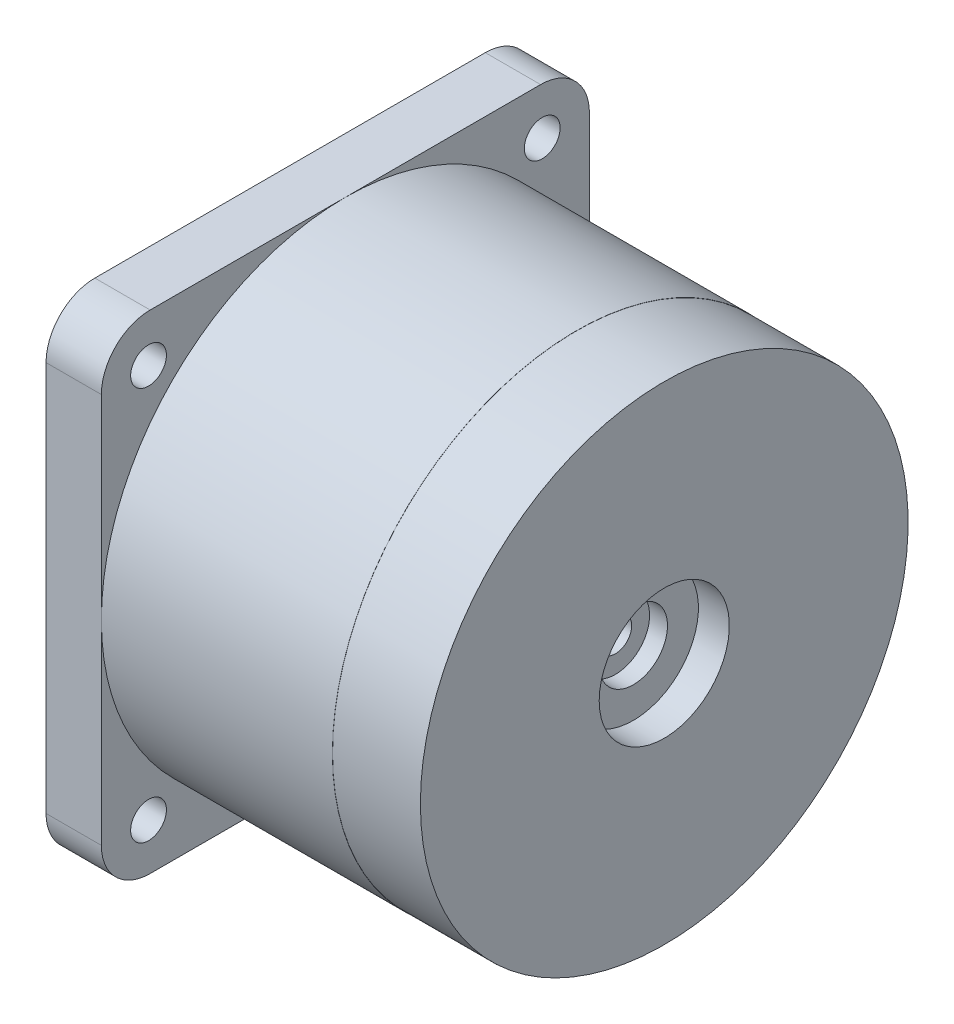
ISO-10303-21;
HEADER;
FILE_DESCRIPTION(('STEP AP214'),'2;1');
FILE_NAME('part.step','',(''),(''),'','','');
FILE_SCHEMA(('AUTOMOTIVE_DESIGN { 1 0 10303 214 1 1 1 1 }'));
ENDSEC;
DATA;
#1=APPLICATION_CONTEXT('core data for automotive mechanical design processes');
#2=APPLICATION_PROTOCOL_DEFINITION('international standard','automotive_design',2000,#1);
#3=PRODUCT_CONTEXT('',#1,'mechanical');
#4=PRODUCT('Part','Part','',(#3));
#5=PRODUCT_RELATED_PRODUCT_CATEGORY('part','',(#4));
#6=PRODUCT_DEFINITION_FORMATION('','',#4);
#7=PRODUCT_DEFINITION_CONTEXT('part definition',#1,'design');
#8=PRODUCT_DEFINITION('design','',#6,#7);
#9=PRODUCT_DEFINITION_SHAPE('','',#8);
#10=(LENGTH_UNIT() NAMED_UNIT(*) SI_UNIT(.MILLI.,.METRE.));
#11=(NAMED_UNIT(*) PLANE_ANGLE_UNIT() SI_UNIT($,.RADIAN.));
#12=(NAMED_UNIT(*) SI_UNIT($,.STERADIAN.) SOLID_ANGLE_UNIT());
#13=UNCERTAINTY_MEASURE_WITH_UNIT(LENGTH_MEASURE(1.E-05),#10,'distance_accuracy_value','');
#14=(GEOMETRIC_REPRESENTATION_CONTEXT(3) GLOBAL_UNCERTAINTY_ASSIGNED_CONTEXT((#13)) GLOBAL_UNIT_ASSIGNED_CONTEXT((#10,
#11,#12)) REPRESENTATION_CONTEXT('',''));
#15=CARTESIAN_POINT('',(0.,0.,0.));
#16=DIRECTION('',(0.,0.,1.));
#17=DIRECTION('',(1.,0.,0.));
#18=AXIS2_PLACEMENT_3D('',#15,#16,#17);
#19=CARTESIAN_POINT('',(0.,0.,0.));
#20=DIRECTION('',(-1.,0.,0.));
#21=DIRECTION('',(0.,0.,1.));
#22=AXIS2_PLACEMENT_3D('',#19,#20,#21);
#23=PLANE('',#22);
#24=CARTESIAN_POINT('',(0.,0.,0.));
#25=DIRECTION('',(-1.,0.,0.));
#26=DIRECTION('',(0.,0.,1.));
#27=AXIS2_PLACEMENT_3D('',#24,#25,#26);
#28=CIRCLE('',#27,14.99);
#29=CARTESIAN_POINT('',(0.,0.,14.99));
#30=VERTEX_POINT('',#29);
#31=EDGE_CURVE('E169',#30,#30,#28,.T.);
#32=ORIENTED_EDGE('',*,*,#31,.F.);
#33=EDGE_LOOP('',(#32));
#34=FACE_BOUND('',#33,.T.);
#35=CARTESIAN_POINT('',(0.,0.,0.));
#36=DIRECTION('',(-1.,0.,0.));
#37=DIRECTION('',(0.,0.,1.));
#38=AXIS2_PLACEMENT_3D('',#35,#36,#37);
#39=CIRCLE('',#38,4.);
#40=CARTESIAN_POINT('',(0.,0.,4.));
#41=VERTEX_POINT('',#40);
#42=EDGE_CURVE('E261',#41,#41,#39,.T.);
#43=ORIENTED_EDGE('',*,*,#42,.T.);
#44=EDGE_LOOP('',(#43));
#45=FACE_BOUND('',#44,.T.);
#46=ADVANCED_FACE('F32',(#34,#45),#23,.F.);
#47=CARTESIAN_POINT('',(-21.4,0.,0.));
#48=DIRECTION('',(-1.,0.,0.));
#49=DIRECTION('',(0.,0.,1.));
#50=AXIS2_PLACEMENT_3D('',#47,#48,#49);
#51=PLANE('',#50);
#52=CARTESIAN_POINT('',(-21.4,0.,0.));
#53=DIRECTION('',(-1.,0.,0.));
#54=DIRECTION('',(0.,0.,1.));
#55=AXIS2_PLACEMENT_3D('',#52,#53,#54);
#56=CIRCLE('',#55,13.5);
#57=CARTESIAN_POINT('',(-21.4,0.,13.5));
#58=VERTEX_POINT('',#57);
#59=EDGE_CURVE('E249',#58,#58,#56,.T.);
#60=ORIENTED_EDGE('',*,*,#59,.T.);
#61=EDGE_LOOP('',(#60));
#62=FACE_BOUND('',#61,.T.);
#63=CARTESIAN_POINT('',(-21.4,-4.9,0.));
#64=DIRECTION('',(-1.,0.,0.));
#65=DIRECTION('',(0.,0.,1.));
#66=AXIS2_PLACEMENT_3D('',#63,#64,#65);
#67=CIRCLE('',#66,5.);
#68=CARTESIAN_POINT('',(-21.4,-4.9,5.));
#69=VERTEX_POINT('',#68);
#70=EDGE_CURVE('E258',#69,#69,#67,.T.);
#71=ORIENTED_EDGE('',*,*,#70,.F.);
#72=EDGE_LOOP('',(#71));
#73=FACE_BOUND('',#72,.T.);
#74=ADVANCED_FACE('F292',(#62,#73),#51,.T.);
#75=CARTESIAN_POINT('',(0.,0.,0.));
#76=DIRECTION('',(-1.,0.,0.));
#77=DIRECTION('',(0.,0.,1.));
#78=AXIS2_PLACEMENT_3D('',#75,#76,#77);
#79=CYLINDRICAL_SURFACE('',#78,14.99);
#80=CARTESIAN_POINT('',(-5.4,0.,0.));
#81=DIRECTION('',(-1.,0.,0.));
#82=DIRECTION('',(0.,0.,1.));
#83=AXIS2_PLACEMENT_3D('',#80,#81,#82);
#84=CIRCLE('',#83,14.99);
#85=CARTESIAN_POINT('',(-5.4,0.,14.99));
#86=VERTEX_POINT('',#85);
#87=EDGE_CURVE('E166',#86,#86,#84,.T.);
#88=ORIENTED_EDGE('',*,*,#87,.F.);
#89=EDGE_LOOP('',(#88));
#90=FACE_BOUND('',#89,.T.);
#91=ORIENTED_EDGE('',*,*,#31,.T.);
#92=EDGE_LOOP('',(#91));
#93=FACE_BOUND('',#92,.T.);
#94=ADVANCED_FACE('F297',(#90,#93),#79,.T.);
#95=CARTESIAN_POINT('',(-5.4,14.99,0.));
#96=DIRECTION('',(-1.,0.,0.));
#97=DIRECTION('',(0.,0.,1.));
#98=AXIS2_PLACEMENT_3D('',#95,#96,#97);
#99=PLANE('',#98);
#100=CARTESIAN_POINT('',(-5.4,0.,0.));
#101=DIRECTION('',(-1.,0.,0.));
#102=DIRECTION('',(0.,0.,1.));
#103=AXIS2_PLACEMENT_3D('',#100,#101,#102);
#104=CIRCLE('',#103,15.);
#105=CARTESIAN_POINT('',(-5.4,0.,15.));
#106=VERTEX_POINT('',#105);
#107=EDGE_CURVE('E137',#106,#106,#104,.T.);
#108=ORIENTED_EDGE('',*,*,#107,.F.);
#109=EDGE_LOOP('',(#108));
#110=FACE_BOUND('',#109,.T.);
#111=ORIENTED_EDGE('',*,*,#87,.T.);
#112=EDGE_LOOP('',(#111));
#113=FACE_BOUND('',#112,.T.);
#114=ADVANCED_FACE('F373',(#110,#113),#99,.F.);
#115=CARTESIAN_POINT('',(0.,0.,0.));
#116=DIRECTION('',(-1.,0.,0.));
#117=DIRECTION('',(0.,0.,1.));
#118=AXIS2_PLACEMENT_3D('',#115,#116,#117);
#119=CYLINDRICAL_SURFACE('',#118,15.);
#120=CARTESIAN_POINT('',(-19.6,0.,0.));
#121=DIRECTION('',(-1.,0.,0.));
#122=DIRECTION('',(0.,0.,1.));
#123=AXIS2_PLACEMENT_3D('',#120,#121,#122);
#124=CIRCLE('',#123,15.);
#125=CARTESIAN_POINT('',(-19.6,0.,15.));
#126=VERTEX_POINT('',#125);
#127=CARTESIAN_POINT('',(-19.6,15.,0.));
#128=VERTEX_POINT('',#127);
#129=EDGE_CURVE('E126',#126,#128,#124,.T.);
#130=ORIENTED_EDGE('',*,*,#129,.F.);
#131=CARTESIAN_POINT('',(-19.6,-15.,0.));
#132=VERTEX_POINT('',#131);
#133=EDGE_CURVE('E130',#132,#126,#124,.T.);
#134=ORIENTED_EDGE('',*,*,#133,.F.);
#135=CARTESIAN_POINT('',(-19.6,0.,-15.));
#136=VERTEX_POINT('',#135);
#137=EDGE_CURVE('E143',#136,#132,#124,.T.);
#138=ORIENTED_EDGE('',*,*,#137,.F.);
#139=EDGE_CURVE('E133',#128,#136,#124,.T.);
#140=ORIENTED_EDGE('',*,*,#139,.F.);
#141=EDGE_LOOP('',(#130,#134,#138,#140));
#142=FACE_BOUND('',#141,.T.);
#143=ORIENTED_EDGE('',*,*,#107,.T.);
#144=EDGE_LOOP('',(#143));
#145=FACE_BOUND('',#144,.T.);
#146=ADVANCED_FACE('F127',(#142,#145),#119,.T.);
#147=CARTESIAN_POINT('',(-19.6,-15.,-15.));
#148=DIRECTION('',(-1.,0.,0.));
#149=DIRECTION('',(0.,0.,1.));
#150=AXIS2_PLACEMENT_3D('',#147,#148,#149);
#151=PLANE('',#150);
#152=CARTESIAN_POINT('',(-19.6,12.1,12.1));
#153=DIRECTION('',(-1.,0.,0.));
#154=DIRECTION('',(0.,0.,1.));
#155=AXIS2_PLACEMENT_3D('',#152,#153,#154);
#156=CIRCLE('',#155,1.1);
#157=CARTESIAN_POINT('',(-19.6,12.1,13.2));
#158=VERTEX_POINT('',#157);
#159=EDGE_CURVE('E234',#158,#158,#156,.T.);
#160=ORIENTED_EDGE('',*,*,#159,.T.);
#161=EDGE_LOOP('',(#160));
#162=FACE_BOUND('',#161,.T.);
#163=DIRECTION('',(0.,0.,-1.));
#164=VECTOR('',#163,1.);
#165=CARTESIAN_POINT('',(-19.6,15.,-15.));
#166=LINE('',#165,#164);
#167=CARTESIAN_POINT('',(-19.6,15.,12.));
#168=VERTEX_POINT('',#167);
#169=EDGE_CURVE('E151',#168,#128,#166,.T.);
#170=ORIENTED_EDGE('',*,*,#169,.F.);
#171=CARTESIAN_POINT('',(-19.6,12.,12.));
#172=DIRECTION('',(-1.,0.,0.));
#173=DIRECTION('',(0.,0.,1.));
#174=AXIS2_PLACEMENT_3D('',#171,#172,#173);
#175=CIRCLE('',#174,3.);
#176=CARTESIAN_POINT('',(-19.6,12.,15.));
#177=VERTEX_POINT('',#176);
#178=EDGE_CURVE('E146',#168,#177,#175,.F.);
#179=ORIENTED_EDGE('',*,*,#178,.T.);
#180=DIRECTION('',(0.,1.,0.));
#181=VECTOR('',#180,1.);
#182=CARTESIAN_POINT('',(-19.6,15.,15.));
#183=LINE('',#182,#181);
#184=EDGE_CURVE('E113',#126,#177,#183,.T.);
#185=ORIENTED_EDGE('',*,*,#184,.F.);
#186=ORIENTED_EDGE('',*,*,#129,.T.);
#187=EDGE_LOOP('',(#170,#179,#185,#186));
#188=FACE_BOUND('',#187,.T.);
#189=ADVANCED_FACE('F145',(#162,#188),#151,.F.);
#190=CARTESIAN_POINT('',(-19.6,12.1,-12.1));
#191=DIRECTION('',(-1.,0.,0.));
#192=DIRECTION('',(0.,0.,1.));
#193=AXIS2_PLACEMENT_3D('',#190,#191,#192);
#194=CIRCLE('',#193,1.1);
#195=CARTESIAN_POINT('',(-19.6,12.1,-11.));
#196=VERTEX_POINT('',#195);
#197=EDGE_CURVE('E228',#196,#196,#194,.T.);
#198=ORIENTED_EDGE('',*,*,#197,.T.);
#199=EDGE_LOOP('',(#198));
#200=FACE_BOUND('',#199,.T.);
#201=DIRECTION('',(0.,-1.,0.));
#202=VECTOR('',#201,1.);
#203=CARTESIAN_POINT('',(-19.6,15.,-15.));
#204=LINE('',#203,#202);
#205=CARTESIAN_POINT('',(-19.6,12.,-15.));
#206=VERTEX_POINT('',#205);
#207=EDGE_CURVE('E218',#206,#136,#204,.T.);
#208=ORIENTED_EDGE('',*,*,#207,.F.);
#209=CARTESIAN_POINT('',(-19.6,12.,-12.));
#210=DIRECTION('',(-1.,0.,0.));
#211=DIRECTION('',(0.,0.,1.));
#212=AXIS2_PLACEMENT_3D('',#209,#210,#211);
#213=CIRCLE('',#212,3.);
#214=CARTESIAN_POINT('',(-19.6,15.,-12.));
#215=VERTEX_POINT('',#214);
#216=EDGE_CURVE('E11',#206,#215,#213,.F.);
#217=ORIENTED_EDGE('',*,*,#216,.T.);
#218=EDGE_CURVE('E120',#128,#215,#166,.T.);
#219=ORIENTED_EDGE('',*,*,#218,.F.);
#220=ORIENTED_EDGE('',*,*,#139,.T.);
#221=EDGE_LOOP('',(#208,#217,#219,#220));
#222=FACE_BOUND('',#221,.T.);
#223=ADVANCED_FACE('F217',(#200,#222),#151,.F.);
#224=CARTESIAN_POINT('',(-19.6,-12.1,-12.1));
#225=DIRECTION('',(-1.,0.,0.));
#226=DIRECTION('',(0.,0.,1.));
#227=AXIS2_PLACEMENT_3D('',#224,#225,#226);
#228=CIRCLE('',#227,1.1);
#229=CARTESIAN_POINT('',(-19.6,-12.1,-11.));
#230=VERTEX_POINT('',#229);
#231=EDGE_CURVE('E240',#230,#230,#228,.T.);
#232=ORIENTED_EDGE('',*,*,#231,.T.);
#233=EDGE_LOOP('',(#232));
#234=FACE_BOUND('',#233,.T.);
#235=DIRECTION('',(0.,0.,1.));
#236=VECTOR('',#235,1.);
#237=CARTESIAN_POINT('',(-19.6,-15.,-15.));
#238=LINE('',#237,#236);
#239=CARTESIAN_POINT('',(-19.6,-15.,-12.));
#240=VERTEX_POINT('',#239);
#241=EDGE_CURVE('E147',#240,#132,#238,.T.);
#242=ORIENTED_EDGE('',*,*,#241,.F.);
#243=CARTESIAN_POINT('',(-19.6,-12.,-12.));
#244=DIRECTION('',(-1.,0.,0.));
#245=DIRECTION('',(0.,0.,1.));
#246=AXIS2_PLACEMENT_3D('',#243,#244,#245);
#247=CIRCLE('',#246,3.);
#248=CARTESIAN_POINT('',(-19.6,-12.,-15.));
#249=VERTEX_POINT('',#248);
#250=EDGE_CURVE('E52',#240,#249,#247,.F.);
#251=ORIENTED_EDGE('',*,*,#250,.T.);
#252=EDGE_CURVE('E202',#136,#249,#204,.T.);
#253=ORIENTED_EDGE('',*,*,#252,.F.);
#254=ORIENTED_EDGE('',*,*,#137,.T.);
#255=EDGE_LOOP('',(#242,#251,#253,#254));
#256=FACE_BOUND('',#255,.T.);
#257=ADVANCED_FACE('F214',(#234,#256),#151,.F.);
#258=CARTESIAN_POINT('',(-19.6,-12.1,12.1));
#259=DIRECTION('',(-1.,0.,0.));
#260=DIRECTION('',(0.,0.,1.));
#261=AXIS2_PLACEMENT_3D('',#258,#259,#260);
#262=CIRCLE('',#261,1.1);
#263=CARTESIAN_POINT('',(-19.6,-12.1,13.2));
#264=VERTEX_POINT('',#263);
#265=EDGE_CURVE('E246',#264,#264,#262,.T.);
#266=ORIENTED_EDGE('',*,*,#265,.T.);
#267=EDGE_LOOP('',(#266));
#268=FACE_BOUND('',#267,.T.);
#269=CARTESIAN_POINT('',(-19.6,-12.,15.));
#270=VERTEX_POINT('',#269);
#271=EDGE_CURVE('E109',#270,#126,#183,.T.);
#272=ORIENTED_EDGE('',*,*,#271,.F.);
#273=CARTESIAN_POINT('',(-19.6,-12.,12.));
#274=DIRECTION('',(-1.,0.,0.));
#275=DIRECTION('',(0.,0.,1.));
#276=AXIS2_PLACEMENT_3D('',#273,#274,#275);
#277=CIRCLE('',#276,3.);
#278=CARTESIAN_POINT('',(-19.6,-15.,12.));
#279=VERTEX_POINT('',#278);
#280=EDGE_CURVE('E189',#270,#279,#277,.F.);
#281=ORIENTED_EDGE('',*,*,#280,.T.);
#282=EDGE_CURVE('E142',#132,#279,#238,.T.);
#283=ORIENTED_EDGE('',*,*,#282,.F.);
#284=ORIENTED_EDGE('',*,*,#133,.T.);
#285=EDGE_LOOP('',(#272,#281,#283,#284));
#286=FACE_BOUND('',#285,.T.);
#287=ADVANCED_FACE('F140',(#268,#286),#151,.F.);
#288=CARTESIAN_POINT('',(-23.,-15.,-15.));
#289=DIRECTION('',(-1.,0.,0.));
#290=DIRECTION('',(0.,0.,1.));
#291=AXIS2_PLACEMENT_3D('',#288,#289,#290);
#292=PLANE('',#291);
#293=CARTESIAN_POINT('',(-23.,0.,0.));
#294=DIRECTION('',(-1.,0.,0.));
#295=DIRECTION('',(0.,0.,1.));
#296=AXIS2_PLACEMENT_3D('',#293,#294,#295);
#297=CIRCLE('',#296,13.5);
#298=CARTESIAN_POINT('',(-23.,0.,13.5));
#299=VERTEX_POINT('',#298);
#300=EDGE_CURVE('E252',#299,#299,#297,.T.);
#301=ORIENTED_EDGE('',*,*,#300,.F.);
#302=EDGE_LOOP('',(#301));
#303=FACE_BOUND('',#302,.T.);
#304=CARTESIAN_POINT('',(-23.,-12.1,-12.1));
#305=DIRECTION('',(-1.,0.,0.));
#306=DIRECTION('',(0.,0.,1.));
#307=AXIS2_PLACEMENT_3D('',#304,#305,#306);
#308=CIRCLE('',#307,1.1);
#309=CARTESIAN_POINT('',(-23.,-12.1,-11.));
#310=VERTEX_POINT('',#309);
#311=EDGE_CURVE('E237',#310,#310,#308,.T.);
#312=ORIENTED_EDGE('',*,*,#311,.F.);
#313=EDGE_LOOP('',(#312));
#314=FACE_BOUND('',#313,.T.);
#315=CARTESIAN_POINT('',(-23.,12.1,-12.1));
#316=DIRECTION('',(-1.,0.,0.));
#317=DIRECTION('',(0.,0.,1.));
#318=AXIS2_PLACEMENT_3D('',#315,#316,#317);
#319=CIRCLE('',#318,1.1);
#320=CARTESIAN_POINT('',(-23.,12.1,-11.));
#321=VERTEX_POINT('',#320);
#322=EDGE_CURVE('E224',#321,#321,#319,.T.);
#323=ORIENTED_EDGE('',*,*,#322,.F.);
#324=EDGE_LOOP('',(#323));
#325=FACE_BOUND('',#324,.T.);
#326=DIRECTION('',(0.,1.,0.));
#327=VECTOR('',#326,1.);
#328=CARTESIAN_POINT('',(-23.,15.,15.));
#329=LINE('',#328,#327);
#330=CARTESIAN_POINT('',(-23.,-12.,15.));
#331=VERTEX_POINT('',#330);
#332=CARTESIAN_POINT('',(-23.,12.,15.));
#333=VERTEX_POINT('',#332);
#334=EDGE_CURVE('E159',#331,#333,#329,.T.);
#335=ORIENTED_EDGE('',*,*,#334,.T.);
#336=CARTESIAN_POINT('',(-23.,12.,12.));
#337=DIRECTION('',(-1.,0.,0.));
#338=DIRECTION('',(0.,0.,1.));
#339=AXIS2_PLACEMENT_3D('',#336,#337,#338);
#340=CIRCLE('',#339,3.);
#341=CARTESIAN_POINT('',(-23.,15.,12.));
#342=VERTEX_POINT('',#341);
#343=EDGE_CURVE('E187',#333,#342,#340,.T.);
#344=ORIENTED_EDGE('',*,*,#343,.T.);
#345=DIRECTION('',(0.,0.,-1.));
#346=VECTOR('',#345,1.);
#347=CARTESIAN_POINT('',(-23.,15.,-15.));
#348=LINE('',#347,#346);
#349=CARTESIAN_POINT('',(-23.,15.,-12.));
#350=VERTEX_POINT('',#349);
#351=EDGE_CURVE('E144',#342,#350,#348,.T.);
#352=ORIENTED_EDGE('',*,*,#351,.T.);
#353=CARTESIAN_POINT('',(-23.,12.,-12.));
#354=DIRECTION('',(-1.,0.,0.));
#355=DIRECTION('',(0.,0.,1.));
#356=AXIS2_PLACEMENT_3D('',#353,#354,#355);
#357=CIRCLE('',#356,3.);
#358=CARTESIAN_POINT('',(-23.,12.,-15.));
#359=VERTEX_POINT('',#358);
#360=EDGE_CURVE('E181',#350,#359,#357,.T.);
#361=ORIENTED_EDGE('',*,*,#360,.T.);
#362=DIRECTION('',(0.,-1.,0.));
#363=VECTOR('',#362,1.);
#364=CARTESIAN_POINT('',(-23.,15.,-15.));
#365=LINE('',#364,#363);
#366=CARTESIAN_POINT('',(-23.,-12.,-15.));
#367=VERTEX_POINT('',#366);
#368=EDGE_CURVE('E153',#359,#367,#365,.T.);
#369=ORIENTED_EDGE('',*,*,#368,.T.);
#370=CARTESIAN_POINT('',(-23.,-12.,-12.));
#371=DIRECTION('',(-1.,0.,0.));
#372=DIRECTION('',(0.,0.,1.));
#373=AXIS2_PLACEMENT_3D('',#370,#371,#372);
#374=CIRCLE('',#373,3.);
#375=CARTESIAN_POINT('',(-23.,-15.,-12.));
#376=VERTEX_POINT('',#375);
#377=EDGE_CURVE('E183',#367,#376,#374,.T.);
#378=ORIENTED_EDGE('',*,*,#377,.T.);
#379=DIRECTION('',(0.,0.,1.));
#380=VECTOR('',#379,1.);
#381=CARTESIAN_POINT('',(-23.,-15.,-15.));
#382=LINE('',#381,#380);
#383=CARTESIAN_POINT('',(-23.,-15.,12.));
#384=VERTEX_POINT('',#383);
#385=EDGE_CURVE('E156',#376,#384,#382,.T.);
#386=ORIENTED_EDGE('',*,*,#385,.T.);
#387=CARTESIAN_POINT('',(-23.,-12.,12.));
#388=DIRECTION('',(-1.,0.,0.));
#389=DIRECTION('',(0.,0.,1.));
#390=AXIS2_PLACEMENT_3D('',#387,#388,#389);
#391=CIRCLE('',#390,3.);
#392=EDGE_CURVE('E185',#384,#331,#391,.T.);
#393=ORIENTED_EDGE('',*,*,#392,.T.);
#394=EDGE_LOOP('',(#335,#344,#352,#361,#369,#378,#386,#393));
#395=FACE_BOUND('',#394,.T.);
#396=CARTESIAN_POINT('',(-23.,12.1,12.1));
#397=DIRECTION('',(-1.,0.,0.));
#398=DIRECTION('',(0.,0.,1.));
#399=AXIS2_PLACEMENT_3D('',#396,#397,#398);
#400=CIRCLE('',#399,1.1);
#401=CARTESIAN_POINT('',(-23.,12.1,13.2));
#402=VERTEX_POINT('',#401);
#403=EDGE_CURVE('E231',#402,#402,#400,.T.);
#404=ORIENTED_EDGE('',*,*,#403,.F.);
#405=EDGE_LOOP('',(#404));
#406=FACE_BOUND('',#405,.T.);
#407=CARTESIAN_POINT('',(-23.,-12.1,12.1));
#408=DIRECTION('',(-1.,0.,0.));
#409=DIRECTION('',(0.,0.,1.));
#410=AXIS2_PLACEMENT_3D('',#407,#408,#409);
#411=CIRCLE('',#410,1.1);
#412=CARTESIAN_POINT('',(-23.,-12.1,13.2));
#413=VERTEX_POINT('',#412);
#414=EDGE_CURVE('E243',#413,#413,#411,.T.);
#415=ORIENTED_EDGE('',*,*,#414,.F.);
#416=EDGE_LOOP('',(#415));
#417=FACE_BOUND('',#416,.T.);
#418=ADVANCED_FACE('F206',(#303,#314,#325,#395,#406,#417),#292,.T.);
#419=CARTESIAN_POINT('',(-23.,15.,-15.));
#420=DIRECTION('',(0.,0.,1.));
#421=DIRECTION('',(0.,-1.,0.));
#422=AXIS2_PLACEMENT_3D('',#419,#420,#421);
#423=PLANE('',#422);
#424=ORIENTED_EDGE('',*,*,#252,.T.);
#425=DIRECTION('',(1.,0.,0.));
#426=VECTOR('',#425,1.);
#427=CARTESIAN_POINT('',(-23.,-12.,-15.));
#428=LINE('',#427,#426);
#429=EDGE_CURVE('E39',#249,#367,#428,.F.);
#430=ORIENTED_EDGE('',*,*,#429,.T.);
#431=ORIENTED_EDGE('',*,*,#368,.F.);
#432=DIRECTION('',(1.,0.,0.));
#433=VECTOR('',#432,1.);
#434=CARTESIAN_POINT('',(-23.,12.,-15.));
#435=LINE('',#434,#433);
#436=EDGE_CURVE('E197',#359,#206,#435,.T.);
#437=ORIENTED_EDGE('',*,*,#436,.T.);
#438=ORIENTED_EDGE('',*,*,#207,.T.);
#439=EDGE_LOOP('',(#424,#430,#431,#437,#438));
#440=FACE_BOUND('',#439,.T.);
#441=ADVANCED_FACE('F201',(#440),#423,.F.);
#442=CARTESIAN_POINT('',(-23.,-15.,-15.));
#443=DIRECTION('',(0.,1.,0.));
#444=DIRECTION('',(0.,0.,1.));
#445=AXIS2_PLACEMENT_3D('',#442,#443,#444);
#446=PLANE('',#445);
#447=ORIENTED_EDGE('',*,*,#282,.T.);
#448=DIRECTION('',(1.,0.,0.));
#449=VECTOR('',#448,1.);
#450=CARTESIAN_POINT('',(-23.,-15.,12.));
#451=LINE('',#450,#449);
#452=EDGE_CURVE('E194',#279,#384,#451,.F.);
#453=ORIENTED_EDGE('',*,*,#452,.T.);
#454=ORIENTED_EDGE('',*,*,#385,.F.);
#455=DIRECTION('',(1.,0.,0.));
#456=VECTOR('',#455,1.);
#457=CARTESIAN_POINT('',(-23.,-15.,-12.));
#458=LINE('',#457,#456);
#459=EDGE_CURVE('E191',#376,#240,#458,.T.);
#460=ORIENTED_EDGE('',*,*,#459,.T.);
#461=ORIENTED_EDGE('',*,*,#241,.T.);
#462=EDGE_LOOP('',(#447,#453,#454,#460,#461));
#463=FACE_BOUND('',#462,.T.);
#464=ADVANCED_FACE('F213',(#463),#446,.F.);
#465=CARTESIAN_POINT('',(-23.,15.,15.));
#466=DIRECTION('',(0.,0.,-1.));
#467=DIRECTION('',(0.,1.,0.));
#468=AXIS2_PLACEMENT_3D('',#465,#466,#467);
#469=PLANE('',#468);
#470=ORIENTED_EDGE('',*,*,#184,.T.);
#471=DIRECTION('',(1.,0.,0.));
#472=VECTOR('',#471,1.);
#473=CARTESIAN_POINT('',(-23.,12.,15.));
#474=LINE('',#473,#472);
#475=EDGE_CURVE('E179',#177,#333,#474,.F.);
#476=ORIENTED_EDGE('',*,*,#475,.T.);
#477=ORIENTED_EDGE('',*,*,#334,.F.);
#478=DIRECTION('',(1.,0.,0.));
#479=VECTOR('',#478,1.);
#480=CARTESIAN_POINT('',(-23.,-12.,15.));
#481=LINE('',#480,#479);
#482=EDGE_CURVE('E117',#331,#270,#481,.T.);
#483=ORIENTED_EDGE('',*,*,#482,.T.);
#484=ORIENTED_EDGE('',*,*,#271,.T.);
#485=EDGE_LOOP('',(#470,#476,#477,#483,#484));
#486=FACE_BOUND('',#485,.T.);
#487=ADVANCED_FACE('F111',(#486),#469,.F.);
#488=CARTESIAN_POINT('',(-23.,15.,-15.));
#489=DIRECTION('',(0.,-1.,0.));
#490=DIRECTION('',(0.,0.,-1.));
#491=AXIS2_PLACEMENT_3D('',#488,#489,#490);
#492=PLANE('',#491);
#493=ORIENTED_EDGE('',*,*,#351,.F.);
#494=DIRECTION('',(1.,0.,0.));
#495=VECTOR('',#494,1.);
#496=CARTESIAN_POINT('',(-23.,15.,12.));
#497=LINE('',#496,#495);
#498=EDGE_CURVE('E174',#342,#168,#497,.T.);
#499=ORIENTED_EDGE('',*,*,#498,.T.);
#500=ORIENTED_EDGE('',*,*,#169,.T.);
#501=ORIENTED_EDGE('',*,*,#218,.T.);
#502=DIRECTION('',(1.,0.,0.));
#503=VECTOR('',#502,1.);
#504=CARTESIAN_POINT('',(-23.,15.,-12.));
#505=LINE('',#504,#503);
#506=EDGE_CURVE('E172',#215,#350,#505,.F.);
#507=ORIENTED_EDGE('',*,*,#506,.T.);
#508=EDGE_LOOP('',(#493,#499,#500,#501,#507));
#509=FACE_BOUND('',#508,.T.);
#510=ADVANCED_FACE('F222',(#509),#492,.F.);
#511=CARTESIAN_POINT('',(-23.,12.1,-12.1));
#512=DIRECTION('',(1.,0.,0.));
#513=DIRECTION('',(0.,0.,-1.));
#514=AXIS2_PLACEMENT_3D('',#511,#512,#513);
#515=CYLINDRICAL_SURFACE('',#514,1.1);
#516=ORIENTED_EDGE('',*,*,#322,.T.);
#517=EDGE_LOOP('',(#516));
#518=FACE_BOUND('',#517,.T.);
#519=ORIENTED_EDGE('',*,*,#197,.F.);
#520=EDGE_LOOP('',(#519));
#521=FACE_BOUND('',#520,.T.);
#522=ADVANCED_FACE('F352',(#518,#521),#515,.F.);
#523=CARTESIAN_POINT('',(-23.,12.1,12.1));
#524=DIRECTION('',(1.,0.,0.));
#525=DIRECTION('',(0.,0.,-1.));
#526=AXIS2_PLACEMENT_3D('',#523,#524,#525);
#527=CYLINDRICAL_SURFACE('',#526,1.1);
#528=ORIENTED_EDGE('',*,*,#403,.T.);
#529=EDGE_LOOP('',(#528));
#530=FACE_BOUND('',#529,.T.);
#531=ORIENTED_EDGE('',*,*,#159,.F.);
#532=EDGE_LOOP('',(#531));
#533=FACE_BOUND('',#532,.T.);
#534=ADVANCED_FACE('F348',(#530,#533),#527,.F.);
#535=CARTESIAN_POINT('',(-23.,-12.1,-12.1));
#536=DIRECTION('',(1.,0.,0.));
#537=DIRECTION('',(0.,0.,-1.));
#538=AXIS2_PLACEMENT_3D('',#535,#536,#537);
#539=CYLINDRICAL_SURFACE('',#538,1.1);
#540=ORIENTED_EDGE('',*,*,#311,.T.);
#541=EDGE_LOOP('',(#540));
#542=FACE_BOUND('',#541,.T.);
#543=ORIENTED_EDGE('',*,*,#231,.F.);
#544=EDGE_LOOP('',(#543));
#545=FACE_BOUND('',#544,.T.);
#546=ADVANCED_FACE('F344',(#542,#545),#539,.F.);
#547=CARTESIAN_POINT('',(-23.,-12.1,12.1));
#548=DIRECTION('',(1.,0.,0.));
#549=DIRECTION('',(0.,0.,-1.));
#550=AXIS2_PLACEMENT_3D('',#547,#548,#549);
#551=CYLINDRICAL_SURFACE('',#550,1.1);
#552=ORIENTED_EDGE('',*,*,#414,.T.);
#553=EDGE_LOOP('',(#552));
#554=FACE_BOUND('',#553,.T.);
#555=ORIENTED_EDGE('',*,*,#265,.F.);
#556=EDGE_LOOP('',(#555));
#557=FACE_BOUND('',#556,.T.);
#558=ADVANCED_FACE('F340',(#554,#557),#551,.F.);
#559=CARTESIAN_POINT('',(-21.4,0.,0.));
#560=DIRECTION('',(-1.,0.,0.));
#561=DIRECTION('',(0.,0.,1.));
#562=AXIS2_PLACEMENT_3D('',#559,#560,#561);
#563=CYLINDRICAL_SURFACE('',#562,13.5);
#564=ORIENTED_EDGE('',*,*,#59,.F.);
#565=EDGE_LOOP('',(#564));
#566=FACE_BOUND('',#565,.T.);
#567=ORIENTED_EDGE('',*,*,#300,.T.);
#568=EDGE_LOOP('',(#567));
#569=FACE_BOUND('',#568,.T.);
#570=ADVANCED_FACE('F335',(#566,#569),#563,.F.);
#571=CARTESIAN_POINT('',(-23.,12.,12.));
#572=DIRECTION('',(1.,0.,0.));
#573=DIRECTION('',(0.,0.,-1.));
#574=AXIS2_PLACEMENT_3D('',#571,#572,#573);
#575=CYLINDRICAL_SURFACE('',#574,3.);
#576=ORIENTED_EDGE('',*,*,#343,.F.);
#577=ORIENTED_EDGE('',*,*,#475,.F.);
#578=ORIENTED_EDGE('',*,*,#178,.F.);
#579=ORIENTED_EDGE('',*,*,#498,.F.);
#580=EDGE_LOOP('',(#576,#577,#578,#579));
#581=FACE_BOUND('',#580,.T.);
#582=ADVANCED_FACE('F332',(#581),#575,.T.);
#583=CARTESIAN_POINT('',(-23.,-12.,12.));
#584=DIRECTION('',(1.,0.,0.));
#585=DIRECTION('',(0.,0.,-1.));
#586=AXIS2_PLACEMENT_3D('',#583,#584,#585);
#587=CYLINDRICAL_SURFACE('',#586,3.);
#588=ORIENTED_EDGE('',*,*,#392,.F.);
#589=ORIENTED_EDGE('',*,*,#452,.F.);
#590=ORIENTED_EDGE('',*,*,#280,.F.);
#591=ORIENTED_EDGE('',*,*,#482,.F.);
#592=EDGE_LOOP('',(#588,#589,#590,#591));
#593=FACE_BOUND('',#592,.T.);
#594=ADVANCED_FACE('F329',(#593),#587,.T.);
#595=CARTESIAN_POINT('',(-23.,-12.,-12.));
#596=DIRECTION('',(1.,0.,0.));
#597=DIRECTION('',(0.,0.,-1.));
#598=AXIS2_PLACEMENT_3D('',#595,#596,#597);
#599=CYLINDRICAL_SURFACE('',#598,3.);
#600=ORIENTED_EDGE('',*,*,#377,.F.);
#601=ORIENTED_EDGE('',*,*,#429,.F.);
#602=ORIENTED_EDGE('',*,*,#250,.F.);
#603=ORIENTED_EDGE('',*,*,#459,.F.);
#604=EDGE_LOOP('',(#600,#601,#602,#603));
#605=FACE_BOUND('',#604,.T.);
#606=ADVANCED_FACE('F211',(#605),#599,.T.);
#607=CARTESIAN_POINT('',(-23.,12.,-12.));
#608=DIRECTION('',(1.,0.,0.));
#609=DIRECTION('',(0.,0.,-1.));
#610=AXIS2_PLACEMENT_3D('',#607,#608,#609);
#611=CYLINDRICAL_SURFACE('',#610,3.);
#612=ORIENTED_EDGE('',*,*,#360,.F.);
#613=ORIENTED_EDGE('',*,*,#506,.F.);
#614=ORIENTED_EDGE('',*,*,#216,.F.);
#615=ORIENTED_EDGE('',*,*,#436,.F.);
#616=EDGE_LOOP('',(#612,#613,#614,#615));
#617=FACE_BOUND('',#616,.T.);
#618=ADVANCED_FACE('F223',(#617),#611,.T.);
#619=CARTESIAN_POINT('',(-28.95,-4.9,0.));
#620=DIRECTION('',(1.,0.,0.));
#621=DIRECTION('',(0.,0.,-1.));
#622=AXIS2_PLACEMENT_3D('',#619,#620,#621);
#623=CYLINDRICAL_SURFACE('',#622,5.);
#624=CARTESIAN_POINT('',(-28.95,-4.9,0.));
#625=DIRECTION('',(-1.,0.,0.));
#626=DIRECTION('',(0.,0.,1.));
#627=AXIS2_PLACEMENT_3D('',#624,#625,#626);
#628=CIRCLE('',#627,5.);
#629=CARTESIAN_POINT('',(-28.95,-4.9,5.));
#630=VERTEX_POINT('',#629);
#631=EDGE_CURVE('E255',#630,#630,#628,.T.);
#632=ORIENTED_EDGE('',*,*,#631,.F.);
#633=EDGE_LOOP('',(#632));
#634=FACE_BOUND('',#633,.T.);
#635=ORIENTED_EDGE('',*,*,#70,.T.);
#636=EDGE_LOOP('',(#635));
#637=FACE_BOUND('',#636,.T.);
#638=ADVANCED_FACE('F317',(#634,#637),#623,.T.);
#639=CARTESIAN_POINT('',(-28.95,-4.9,0.));
#640=DIRECTION('',(-1.,0.,0.));
#641=DIRECTION('',(0.,0.,1.));
#642=AXIS2_PLACEMENT_3D('',#639,#640,#641);
#643=PLANE('',#642);
#644=ORIENTED_EDGE('',*,*,#631,.T.);
#645=EDGE_LOOP('',(#644));
#646=FACE_BOUND('',#645,.T.);
#647=ADVANCED_FACE('F307',(#646),#643,.T.);
#648=CARTESIAN_POINT('',(0.,0.,0.));
#649=DIRECTION('',(-1.,0.,0.));
#650=DIRECTION('',(0.,0.,1.));
#651=AXIS2_PLACEMENT_3D('',#648,#649,#650);
#652=CYLINDRICAL_SURFACE('',#651,4.);
#653=CARTESIAN_POINT('',(-1.9,0.,0.));
#654=DIRECTION('',(-1.,0.,0.));
#655=DIRECTION('',(0.,0.,1.));
#656=AXIS2_PLACEMENT_3D('',#653,#654,#655);
#657=CIRCLE('',#656,4.);
#658=CARTESIAN_POINT('',(-1.9,0.,4.));
#659=VERTEX_POINT('',#658);
#660=EDGE_CURVE('E264',#659,#659,#657,.T.);
#661=ORIENTED_EDGE('',*,*,#660,.T.);
#662=EDGE_LOOP('',(#661));
#663=FACE_BOUND('',#662,.T.);
#664=ORIENTED_EDGE('',*,*,#42,.F.);
#665=EDGE_LOOP('',(#664));
#666=FACE_BOUND('',#665,.T.);
#667=ADVANCED_FACE('F304',(#663,#666),#652,.F.);
#668=CARTESIAN_POINT('',(-1.9,4.,0.));
#669=DIRECTION('',(1.,0.,0.));
#670=DIRECTION('',(0.,0.,-1.));
#671=AXIS2_PLACEMENT_3D('',#668,#669,#670);
#672=PLANE('',#671);
#673=CARTESIAN_POINT('',(-1.9,0.,0.));
#674=DIRECTION('',(-1.,0.,0.));
#675=DIRECTION('',(0.,0.,1.));
#676=AXIS2_PLACEMENT_3D('',#673,#674,#675);
#677=CIRCLE('',#676,2.1);
#678=CARTESIAN_POINT('',(-1.9,0.,2.1));
#679=VERTEX_POINT('',#678);
#680=EDGE_CURVE('E267',#679,#679,#677,.T.);
#681=ORIENTED_EDGE('',*,*,#680,.T.);
#682=EDGE_LOOP('',(#681));
#683=FACE_BOUND('',#682,.T.);
#684=ORIENTED_EDGE('',*,*,#660,.F.);
#685=EDGE_LOOP('',(#684));
#686=FACE_BOUND('',#685,.T.);
#687=ADVANCED_FACE('F306',(#683,#686),#672,.T.);
#688=CARTESIAN_POINT('',(0.,0.,0.));
#689=DIRECTION('',(-1.,0.,0.));
#690=DIRECTION('',(0.,0.,1.));
#691=AXIS2_PLACEMENT_3D('',#688,#689,#690);
#692=CYLINDRICAL_SURFACE('',#691,2.1);
#693=CARTESIAN_POINT('',(-3.,0.,0.));
#694=DIRECTION('',(-1.,0.,0.));
#695=DIRECTION('',(0.,0.,1.));
#696=AXIS2_PLACEMENT_3D('',#693,#694,#695);
#697=CIRCLE('',#696,2.1);
#698=CARTESIAN_POINT('',(-3.,0.,2.1));
#699=VERTEX_POINT('',#698);
#700=EDGE_CURVE('E270',#699,#699,#697,.T.);
#701=ORIENTED_EDGE('',*,*,#700,.T.);
#702=EDGE_LOOP('',(#701));
#703=FACE_BOUND('',#702,.T.);
#704=ORIENTED_EDGE('',*,*,#680,.F.);
#705=EDGE_LOOP('',(#704));
#706=FACE_BOUND('',#705,.T.);
#707=ADVANCED_FACE('F314',(#703,#706),#692,.F.);
#708=CARTESIAN_POINT('',(-3.,2.1,0.));
#709=DIRECTION('',(1.,0.,0.));
#710=DIRECTION('',(0.,0.,-1.));
#711=AXIS2_PLACEMENT_3D('',#708,#709,#710);
#712=PLANE('',#711);
#713=CARTESIAN_POINT('',(-3.,0.,0.));
#714=DIRECTION('',(-1.,0.,0.));
#715=DIRECTION('',(0.,0.,1.));
#716=AXIS2_PLACEMENT_3D('',#713,#714,#715);
#717=CIRCLE('',#716,1.);
#718=CARTESIAN_POINT('',(-3.,0.,1.));
#719=VERTEX_POINT('',#718);
#720=EDGE_CURVE('E273',#719,#719,#717,.T.);
#721=ORIENTED_EDGE('',*,*,#720,.T.);
#722=EDGE_LOOP('',(#721));
#723=FACE_BOUND('',#722,.T.);
#724=ORIENTED_EDGE('',*,*,#700,.F.);
#725=EDGE_LOOP('',(#724));
#726=FACE_BOUND('',#725,.T.);
#727=ADVANCED_FACE('F289',(#723,#726),#712,.T.);
#728=CARTESIAN_POINT('',(0.,0.,0.));
#729=DIRECTION('',(-1.,0.,0.));
#730=DIRECTION('',(0.,0.,1.));
#731=AXIS2_PLACEMENT_3D('',#728,#729,#730);
#732=CYLINDRICAL_SURFACE('',#731,1.);
#733=CARTESIAN_POINT('',(-11.5,0.,0.));
#734=DIRECTION('',(-1.,0.,0.));
#735=DIRECTION('',(0.,0.,1.));
#736=AXIS2_PLACEMENT_3D('',#733,#734,#735);
#737=CIRCLE('',#736,0.999999999999999);
#738=CARTESIAN_POINT('',(-11.5,0.,0.999999999999999));
#739=VERTEX_POINT('',#738);
#740=EDGE_CURVE('E276',#739,#739,#737,.T.);
#741=ORIENTED_EDGE('',*,*,#740,.T.);
#742=EDGE_LOOP('',(#741));
#743=FACE_BOUND('',#742,.T.);
#744=ORIENTED_EDGE('',*,*,#720,.F.);
#745=EDGE_LOOP('',(#744));
#746=FACE_BOUND('',#745,.T.);
#747=ADVANCED_FACE('F280',(#743,#746),#732,.F.);
#748=CARTESIAN_POINT('',(-11.5,0.999999999999999,0.));
#749=DIRECTION('',(1.,0.,0.));
#750=DIRECTION('',(0.,0.,-1.));
#751=AXIS2_PLACEMENT_3D('',#748,#749,#750);
#752=PLANE('',#751);
#753=ORIENTED_EDGE('',*,*,#740,.F.);
#754=EDGE_LOOP('',(#753));
#755=FACE_BOUND('',#754,.T.);
#756=ADVANCED_FACE('F283',(#755),#752,.T.);
#757=CLOSED_SHELL('',(#46,#74,#94,#114,#146,#189,#223,#257,#287,#418,#441,#464,#487,#510,#522,
#534,#546,#558,#570,#582,#594,#606,#618,#638,#647,#667,#687,#707,#727,#747,#756));
#758=MANIFOLD_SOLID_BREP('B2',#757);
#759=ADVANCED_BREP_SHAPE_REPRESENTATION('',(#18,#758),#14);
#760=SHAPE_DEFINITION_REPRESENTATION(#9,#759);
ENDSEC;
END-ISO-10303-21;
